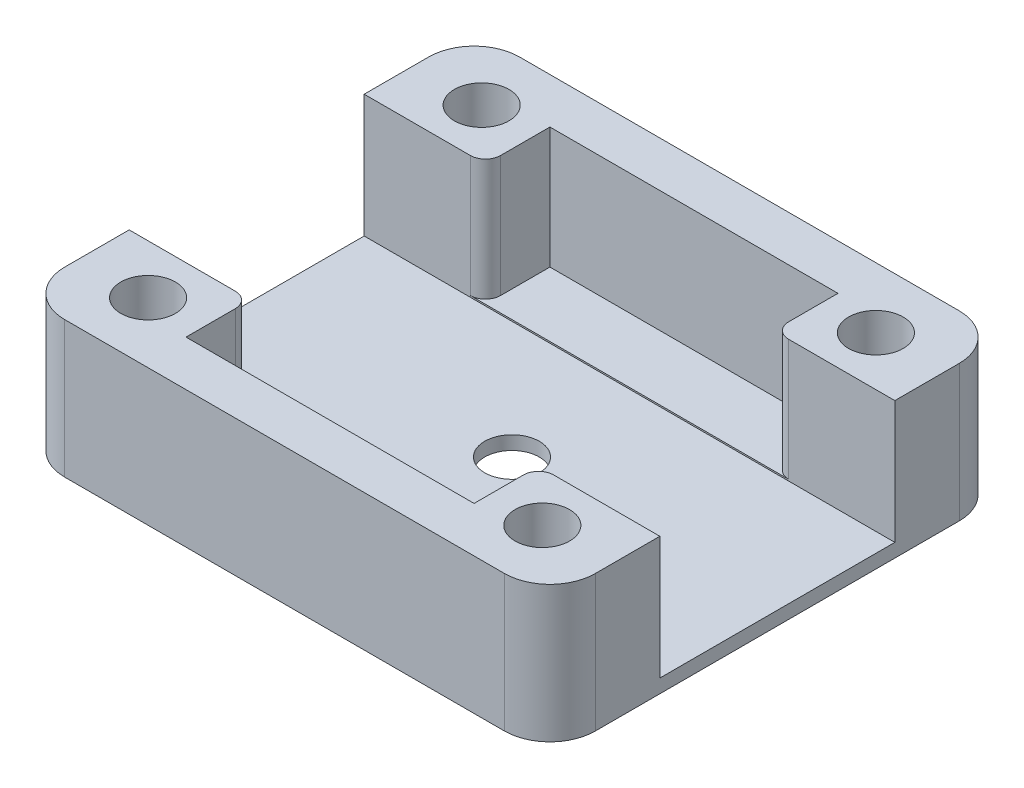
ISO-10303-21;
HEADER;
FILE_DESCRIPTION(('STEP AP214'),'2;1');
FILE_NAME('part.step','',(''),(''),'','','');
FILE_SCHEMA(('AUTOMOTIVE_DESIGN { 1 0 10303 214 1 1 1 1 }'));
ENDSEC;
DATA;
#1=APPLICATION_CONTEXT('core data for automotive mechanical design processes');
#2=APPLICATION_PROTOCOL_DEFINITION('international standard','automotive_design',2000,#1);
#3=PRODUCT_CONTEXT('',#1,'mechanical');
#4=PRODUCT('Part','Part','',(#3));
#5=PRODUCT_RELATED_PRODUCT_CATEGORY('part','',(#4));
#6=PRODUCT_DEFINITION_FORMATION('','',#4);
#7=PRODUCT_DEFINITION_CONTEXT('part definition',#1,'design');
#8=PRODUCT_DEFINITION('design','',#6,#7);
#9=PRODUCT_DEFINITION_SHAPE('','',#8);
#10=(LENGTH_UNIT() NAMED_UNIT(*) SI_UNIT(.MILLI.,.METRE.));
#11=(NAMED_UNIT(*) PLANE_ANGLE_UNIT() SI_UNIT($,.RADIAN.));
#12=(NAMED_UNIT(*) SI_UNIT($,.STERADIAN.) SOLID_ANGLE_UNIT());
#13=UNCERTAINTY_MEASURE_WITH_UNIT(LENGTH_MEASURE(1.E-05),#10,'distance_accuracy_value','');
#14=(GEOMETRIC_REPRESENTATION_CONTEXT(3) GLOBAL_UNCERTAINTY_ASSIGNED_CONTEXT((#13)) GLOBAL_UNIT_ASSIGNED_CONTEXT((#10,
#11,#12)) REPRESENTATION_CONTEXT('',''));
#15=CARTESIAN_POINT('',(0.,0.,0.));
#16=DIRECTION('',(0.,0.,1.));
#17=DIRECTION('',(1.,0.,0.));
#18=AXIS2_PLACEMENT_3D('',#15,#16,#17);
#19=CARTESIAN_POINT('',(0.,0.999999999999999,0.));
#20=DIRECTION('',(0.,1.,0.));
#21=DIRECTION('',(0.,0.,1.));
#22=AXIS2_PLACEMENT_3D('',#19,#20,#21);
#23=PLANE('',#22);
#24=DIRECTION('',(1.,0.,0.));
#25=VECTOR('',#24,1.);
#26=CARTESIAN_POINT('',(0.,0.999999999999999,7.75));
#27=LINE('',#26,#25);
#28=CARTESIAN_POINT('',(-10.5,0.999999999999999,7.75));
#29=VERTEX_POINT('',#28);
#30=CARTESIAN_POINT('',(10.5,0.999999999999999,7.75));
#31=VERTEX_POINT('',#30);
#32=EDGE_CURVE('E285',#29,#31,#27,.T.);
#33=ORIENTED_EDGE('',*,*,#32,.F.);
#34=CARTESIAN_POINT('',(-10.5,0.999999999999999,8.75));
#35=DIRECTION('',(0.,1.,0.));
#36=DIRECTION('',(0.,0.,1.));
#37=AXIS2_PLACEMENT_3D('',#34,#35,#36);
#38=CIRCLE('',#37,1.);
#39=CARTESIAN_POINT('',(-9.49999999999999,0.999999999999999,8.75));
#40=VERTEX_POINT('',#39);
#41=EDGE_CURVE('E350',#29,#40,#38,.F.);
#42=ORIENTED_EDGE('',*,*,#41,.T.);
#43=DIRECTION('',(0.,0.,-1.));
#44=VECTOR('',#43,1.);
#45=CARTESIAN_POINT('',(-9.49999999999999,0.999999999999999,12.));
#46=LINE('',#45,#44);
#47=CARTESIAN_POINT('',(-9.49999999999999,0.999999999999999,12.));
#48=VERTEX_POINT('',#47);
#49=EDGE_CURVE('E744',#48,#40,#46,.T.);
#50=ORIENTED_EDGE('',*,*,#49,.F.);
#51=DIRECTION('',(1.,0.,0.));
#52=VECTOR('',#51,1.);
#53=CARTESIAN_POINT('',(-14.5,0.999999999999999,12.));
#54=LINE('',#53,#52);
#55=CARTESIAN_POINT('',(9.50000000000001,0.999999999999999,12.));
#56=VERTEX_POINT('',#55);
#57=EDGE_CURVE('E254',#48,#56,#54,.T.);
#58=ORIENTED_EDGE('',*,*,#57,.T.);
#59=DIRECTION('',(0.,0.,1.));
#60=VECTOR('',#59,1.);
#61=CARTESIAN_POINT('',(9.50000000000001,0.999999999999999,12.));
#62=LINE('',#61,#60);
#63=CARTESIAN_POINT('',(9.50000000000001,0.999999999999999,8.75));
#64=VERTEX_POINT('',#63);
#65=EDGE_CURVE('E734',#64,#56,#62,.T.);
#66=ORIENTED_EDGE('',*,*,#65,.F.);
#67=CARTESIAN_POINT('',(10.5,0.999999999999999,8.75));
#68=DIRECTION('',(0.,1.,0.));
#69=DIRECTION('',(0.,0.,1.));
#70=AXIS2_PLACEMENT_3D('',#67,#68,#69);
#71=CIRCLE('',#70,1.);
#72=EDGE_CURVE('E347',#64,#31,#71,.F.);
#73=ORIENTED_EDGE('',*,*,#72,.T.);
#74=EDGE_LOOP('',(#33,#42,#50,#58,#66,#73));
#75=FACE_BOUND('',#74,.T.);
#76=ADVANCED_FACE('F40',(#75),#23,.T.);
#77=CARTESIAN_POINT('',(-14.5,0.999999999999999,12.));
#78=DIRECTION('',(0.,0.,1.));
#79=DIRECTION('',(1.,0.,0.));
#80=AXIS2_PLACEMENT_3D('',#77,#78,#79);
#81=PLANE('',#80);
#82=DIRECTION('',(0.,-1.,0.));
#83=VECTOR('',#82,1.);
#84=CARTESIAN_POINT('',(-9.49999999999999,15.5622023742033,12.));
#85=LINE('',#84,#83);
#86=CARTESIAN_POINT('',(-9.49999999999999,9.,12.));
#87=VERTEX_POINT('',#86);
#88=EDGE_CURVE('E736',#87,#48,#85,.T.);
#89=ORIENTED_EDGE('',*,*,#88,.F.);
#90=DIRECTION('',(1.,0.,0.));
#91=VECTOR('',#90,1.);
#92=CARTESIAN_POINT('',(-14.5,9.,12.));
#93=LINE('',#92,#91);
#94=CARTESIAN_POINT('',(9.50000000000001,9.,12.));
#95=VERTEX_POINT('',#94);
#96=EDGE_CURVE('E248',#87,#95,#93,.T.);
#97=ORIENTED_EDGE('',*,*,#96,.T.);
#98=DIRECTION('',(0.,-1.,0.));
#99=VECTOR('',#98,1.);
#100=CARTESIAN_POINT('',(9.50000000000001,15.5622023742033,12.));
#101=LINE('',#100,#99);
#102=EDGE_CURVE('E721',#95,#56,#101,.T.);
#103=ORIENTED_EDGE('',*,*,#102,.T.);
#104=ORIENTED_EDGE('',*,*,#57,.F.);
#105=EDGE_LOOP('',(#89,#97,#103,#104));
#106=FACE_BOUND('',#105,.T.);
#107=ADVANCED_FACE('F420',(#106),#81,.F.);
#108=CARTESIAN_POINT('',(14.5,0.999999999999999,-12.));
#109=DIRECTION('',(0.,0.,-1.));
#110=DIRECTION('',(-1.,0.,0.));
#111=AXIS2_PLACEMENT_3D('',#108,#109,#110);
#112=PLANE('',#111);
#113=DIRECTION('',(0.,-1.,0.));
#114=VECTOR('',#113,1.);
#115=CARTESIAN_POINT('',(9.50000000000001,15.5622023742033,-12.));
#116=LINE('',#115,#114);
#117=CARTESIAN_POINT('',(9.50000000000001,9.,-12.));
#118=VERTEX_POINT('',#117);
#119=CARTESIAN_POINT('',(9.50000000000001,0.999999999999999,-12.));
#120=VERTEX_POINT('',#119);
#121=EDGE_CURVE('E715',#118,#120,#116,.T.);
#122=ORIENTED_EDGE('',*,*,#121,.F.);
#123=DIRECTION('',(-1.,0.,0.));
#124=VECTOR('',#123,1.);
#125=CARTESIAN_POINT('',(14.5,9.,-12.));
#126=LINE('',#125,#124);
#127=CARTESIAN_POINT('',(-9.5,9.,-12.));
#128=VERTEX_POINT('',#127);
#129=EDGE_CURVE('E258',#118,#128,#126,.T.);
#130=ORIENTED_EDGE('',*,*,#129,.T.);
#131=DIRECTION('',(0.,-1.,0.));
#132=VECTOR('',#131,1.);
#133=CARTESIAN_POINT('',(-9.5,15.5622023742033,-12.));
#134=LINE('',#133,#132);
#135=CARTESIAN_POINT('',(-9.5,0.999999999999999,-12.));
#136=VERTEX_POINT('',#135);
#137=EDGE_CURVE('E236',#128,#136,#134,.T.);
#138=ORIENTED_EDGE('',*,*,#137,.T.);
#139=DIRECTION('',(-1.,0.,0.));
#140=VECTOR('',#139,1.);
#141=CARTESIAN_POINT('',(14.5,0.999999999999999,-12.));
#142=LINE('',#141,#140);
#143=EDGE_CURVE('E257',#120,#136,#142,.T.);
#144=ORIENTED_EDGE('',*,*,#143,.F.);
#145=EDGE_LOOP('',(#122,#130,#138,#144));
#146=FACE_BOUND('',#145,.T.);
#147=ADVANCED_FACE('F426',(#146),#112,.F.);
#148=DIRECTION('',(-1.,0.,0.));
#149=VECTOR('',#148,1.);
#150=CARTESIAN_POINT('',(0.,0.999999999999999,-7.75));
#151=LINE('',#150,#149);
#152=CARTESIAN_POINT('',(10.5,0.999999999999999,-7.75));
#153=VERTEX_POINT('',#152);
#154=CARTESIAN_POINT('',(-10.5,0.999999999999999,-7.75));
#155=VERTEX_POINT('',#154);
#156=EDGE_CURVE('E272',#153,#155,#151,.T.);
#157=ORIENTED_EDGE('',*,*,#156,.F.);
#158=CARTESIAN_POINT('',(10.5,0.999999999999999,-8.75));
#159=DIRECTION('',(0.,1.,0.));
#160=DIRECTION('',(0.,0.,1.));
#161=AXIS2_PLACEMENT_3D('',#158,#159,#160);
#162=CIRCLE('',#161,1.);
#163=CARTESIAN_POINT('',(9.50000000000001,0.999999999999999,-8.75));
#164=VERTEX_POINT('',#163);
#165=EDGE_CURVE('E11',#153,#164,#162,.F.);
#166=ORIENTED_EDGE('',*,*,#165,.T.);
#167=DIRECTION('',(0.,0.,1.));
#168=VECTOR('',#167,1.);
#169=CARTESIAN_POINT('',(9.50000000000001,0.999999999999999,-12.));
#170=LINE('',#169,#168);
#171=EDGE_CURVE('E717',#120,#164,#170,.T.);
#172=ORIENTED_EDGE('',*,*,#171,.F.);
#173=ORIENTED_EDGE('',*,*,#143,.T.);
#174=DIRECTION('',(0.,0.,-1.));
#175=VECTOR('',#174,1.);
#176=CARTESIAN_POINT('',(-9.5,0.999999999999999,-12.));
#177=LINE('',#176,#175);
#178=CARTESIAN_POINT('',(-9.5,0.999999999999999,-8.75));
#179=VERTEX_POINT('',#178);
#180=EDGE_CURVE('E355',#179,#136,#177,.T.);
#181=ORIENTED_EDGE('',*,*,#180,.F.);
#182=CARTESIAN_POINT('',(-10.5,0.999999999999999,-8.75));
#183=DIRECTION('',(0.,1.,0.));
#184=DIRECTION('',(0.,0.,1.));
#185=AXIS2_PLACEMENT_3D('',#182,#183,#184);
#186=CIRCLE('',#185,1.);
#187=EDGE_CURVE('E48',#179,#155,#186,.F.);
#188=ORIENTED_EDGE('',*,*,#187,.T.);
#189=EDGE_LOOP('',(#157,#166,#172,#173,#181,#188));
#190=FACE_BOUND('',#189,.T.);
#191=ADVANCED_FACE('F354',(#190),#23,.T.);
#192=CARTESIAN_POINT('',(0.,9.,0.));
#193=DIRECTION('',(0.,-1.,0.));
#194=DIRECTION('',(0.,0.,-1.));
#195=AXIS2_PLACEMENT_3D('',#192,#193,#194);
#196=PLANE('',#195);
#197=CARTESIAN_POINT('',(-13.,9.,11.));
#198=DIRECTION('',(0.,1.,0.));
#199=DIRECTION('',(0.,0.,1.));
#200=AXIS2_PLACEMENT_3D('',#197,#198,#199);
#201=CIRCLE('',#200,1.79999999999999);
#202=CARTESIAN_POINT('',(-13.,9.,12.8));
#203=VERTEX_POINT('',#202);
#204=EDGE_CURVE('E767',#203,#203,#201,.T.);
#205=ORIENTED_EDGE('',*,*,#204,.F.);
#206=EDGE_LOOP('',(#205));
#207=FACE_BOUND('',#206,.T.);
#208=CARTESIAN_POINT('',(13.,9.,11.));
#209=DIRECTION('',(0.,1.,0.));
#210=DIRECTION('',(0.,0.,1.));
#211=AXIS2_PLACEMENT_3D('',#208,#209,#210);
#212=CIRCLE('',#211,1.79999999999999);
#213=CARTESIAN_POINT('',(13.,9.,12.8));
#214=VERTEX_POINT('',#213);
#215=EDGE_CURVE('E751',#214,#214,#212,.T.);
#216=ORIENTED_EDGE('',*,*,#215,.F.);
#217=EDGE_LOOP('',(#216));
#218=FACE_BOUND('',#217,.T.);
#219=DIRECTION('',(-1.,0.,0.));
#220=VECTOR('',#219,1.);
#221=CARTESIAN_POINT('',(17.5,9.,7.75));
#222=LINE('',#221,#220);
#223=CARTESIAN_POINT('',(17.5,9.,7.75));
#224=VERTEX_POINT('',#223);
#225=CARTESIAN_POINT('',(10.5,9.,7.75));
#226=VERTEX_POINT('',#225);
#227=EDGE_CURVE('E202',#224,#226,#222,.T.);
#228=ORIENTED_EDGE('',*,*,#227,.T.);
#229=CARTESIAN_POINT('',(10.5,9.,8.75));
#230=DIRECTION('',(0.,-1.,0.));
#231=DIRECTION('',(0.,0.,-1.));
#232=AXIS2_PLACEMENT_3D('',#229,#230,#231);
#233=CIRCLE('',#232,1.);
#234=CARTESIAN_POINT('',(9.50000000000001,9.,8.75));
#235=VERTEX_POINT('',#234);
#236=EDGE_CURVE('E330',#226,#235,#233,.F.);
#237=ORIENTED_EDGE('',*,*,#236,.T.);
#238=DIRECTION('',(0.,0.,-1.));
#239=VECTOR('',#238,1.);
#240=CARTESIAN_POINT('',(9.50000000000001,9.,12.));
#241=LINE('',#240,#239);
#242=EDGE_CURVE('E723',#95,#235,#241,.T.);
#243=ORIENTED_EDGE('',*,*,#242,.F.);
#244=ORIENTED_EDGE('',*,*,#96,.F.);
#245=DIRECTION('',(0.,0.,1.));
#246=VECTOR('',#245,1.);
#247=CARTESIAN_POINT('',(-9.49999999999999,9.,12.));
#248=LINE('',#247,#246);
#249=CARTESIAN_POINT('',(-9.49999999999999,9.,8.75));
#250=VERTEX_POINT('',#249);
#251=EDGE_CURVE('E738',#250,#87,#248,.T.);
#252=ORIENTED_EDGE('',*,*,#251,.F.);
#253=CARTESIAN_POINT('',(-10.5,9.,8.75));
#254=DIRECTION('',(0.,-1.,0.));
#255=DIRECTION('',(0.,0.,-1.));
#256=AXIS2_PLACEMENT_3D('',#253,#254,#255);
#257=CIRCLE('',#256,1.);
#258=CARTESIAN_POINT('',(-10.5,9.,7.75));
#259=VERTEX_POINT('',#258);
#260=EDGE_CURVE('E328',#250,#259,#257,.F.);
#261=ORIENTED_EDGE('',*,*,#260,.T.);
#262=CARTESIAN_POINT('',(-17.5,9.,7.75));
#263=VERTEX_POINT('',#262);
#264=EDGE_CURVE('E222',#259,#263,#222,.T.);
#265=ORIENTED_EDGE('',*,*,#264,.T.);
#266=DIRECTION('',(0.,0.,1.));
#267=VECTOR('',#266,1.);
#268=CARTESIAN_POINT('',(-17.5,9.,15.));
#269=LINE('',#268,#267);
#270=CARTESIAN_POINT('',(-17.5,9.,12.));
#271=VERTEX_POINT('',#270);
#272=EDGE_CURVE('E266',#263,#271,#269,.T.);
#273=ORIENTED_EDGE('',*,*,#272,.T.);
#274=CARTESIAN_POINT('',(-14.5,9.,12.));
#275=DIRECTION('',(0.,-1.,0.));
#276=DIRECTION('',(0.,0.,-1.));
#277=AXIS2_PLACEMENT_3D('',#274,#275,#276);
#278=CIRCLE('',#277,3.);
#279=CARTESIAN_POINT('',(-14.5,9.,15.));
#280=VERTEX_POINT('',#279);
#281=EDGE_CURVE('E306',#271,#280,#278,.F.);
#282=ORIENTED_EDGE('',*,*,#281,.T.);
#283=DIRECTION('',(1.,0.,0.));
#284=VECTOR('',#283,1.);
#285=CARTESIAN_POINT('',(-17.5,9.,15.));
#286=LINE('',#285,#284);
#287=CARTESIAN_POINT('',(14.5,9.,15.));
#288=VERTEX_POINT('',#287);
#289=EDGE_CURVE('E270',#280,#288,#286,.T.);
#290=ORIENTED_EDGE('',*,*,#289,.T.);
#291=CARTESIAN_POINT('',(14.5,9.,12.));
#292=DIRECTION('',(0.,-1.,0.));
#293=DIRECTION('',(0.,0.,-1.));
#294=AXIS2_PLACEMENT_3D('',#291,#292,#293);
#295=CIRCLE('',#294,3.);
#296=CARTESIAN_POINT('',(17.5,9.,12.));
#297=VERTEX_POINT('',#296);
#298=EDGE_CURVE('E206',#288,#297,#295,.F.);
#299=ORIENTED_EDGE('',*,*,#298,.T.);
#300=DIRECTION('',(0.,0.,-1.));
#301=VECTOR('',#300,1.);
#302=CARTESIAN_POINT('',(17.5,9.,15.));
#303=LINE('',#302,#301);
#304=EDGE_CURVE('E199',#297,#224,#303,.T.);
#305=ORIENTED_EDGE('',*,*,#304,.T.);
#306=EDGE_LOOP('',(#228,#237,#243,#244,#252,#261,#265,#273,#282,#290,#299,#305));
#307=FACE_BOUND('',#306,.T.);
#308=ADVANCED_FACE('F201',(#207,#218,#307),#196,.F.);
#309=CARTESIAN_POINT('',(17.5,9.,15.));
#310=DIRECTION('',(-1.,0.,0.));
#311=DIRECTION('',(0.,0.,1.));
#312=AXIS2_PLACEMENT_3D('',#309,#310,#311);
#313=PLANE('',#312);
#314=ORIENTED_EDGE('',*,*,#304,.F.);
#315=DIRECTION('',(0.,-1.,0.));
#316=VECTOR('',#315,1.);
#317=CARTESIAN_POINT('',(17.5,9.,12.));
#318=LINE('',#317,#316);
#319=CARTESIAN_POINT('',(17.5,0.,12.));
#320=VERTEX_POINT('',#319);
#321=EDGE_CURVE('E310',#297,#320,#318,.T.);
#322=ORIENTED_EDGE('',*,*,#321,.T.);
#323=DIRECTION('',(0.,0.,-1.));
#324=VECTOR('',#323,1.);
#325=CARTESIAN_POINT('',(17.5,0.,15.));
#326=LINE('',#325,#324);
#327=CARTESIAN_POINT('',(17.5,0.,-12.));
#328=VERTEX_POINT('',#327);
#329=EDGE_CURVE('E261',#320,#328,#326,.T.);
#330=ORIENTED_EDGE('',*,*,#329,.T.);
#331=DIRECTION('',(0.,-1.,0.));
#332=VECTOR('',#331,1.);
#333=CARTESIAN_POINT('',(17.5,9.,-12.));
#334=LINE('',#333,#332);
#335=CARTESIAN_POINT('',(17.5,9.,-12.));
#336=VERTEX_POINT('',#335);
#337=EDGE_CURVE('E308',#328,#336,#334,.F.);
#338=ORIENTED_EDGE('',*,*,#337,.T.);
#339=CARTESIAN_POINT('',(17.5,9.,-7.75));
#340=VERTEX_POINT('',#339);
#341=EDGE_CURVE('E212',#340,#336,#303,.T.);
#342=ORIENTED_EDGE('',*,*,#341,.F.);
#343=DIRECTION('',(0.,-1.,0.));
#344=VECTOR('',#343,1.);
#345=CARTESIAN_POINT('',(17.5,0.9,-7.75));
#346=LINE('',#345,#344);
#347=CARTESIAN_POINT('',(17.5,0.9,-7.75));
#348=VERTEX_POINT('',#347);
#349=EDGE_CURVE('E228',#340,#348,#346,.T.);
#350=ORIENTED_EDGE('',*,*,#349,.T.);
#351=DIRECTION('',(0.,0.,1.));
#352=VECTOR('',#351,1.);
#353=CARTESIAN_POINT('',(17.5,0.9,-7.75));
#354=LINE('',#353,#352);
#355=CARTESIAN_POINT('',(17.5,0.9,7.75));
#356=VERTEX_POINT('',#355);
#357=EDGE_CURVE('E227',#348,#356,#354,.T.);
#358=ORIENTED_EDGE('',*,*,#357,.T.);
#359=DIRECTION('',(0.,1.,0.));
#360=VECTOR('',#359,1.);
#361=CARTESIAN_POINT('',(17.5,0.9,7.75));
#362=LINE('',#361,#360);
#363=EDGE_CURVE('E217',#356,#224,#362,.T.);
#364=ORIENTED_EDGE('',*,*,#363,.T.);
#365=EDGE_LOOP('',(#314,#322,#330,#338,#342,#350,#358,#364));
#366=FACE_BOUND('',#365,.T.);
#367=ADVANCED_FACE('F224',(#366),#313,.F.);
#368=CARTESIAN_POINT('',(-17.5,9.,-15.));
#369=DIRECTION('',(0.,0.,1.));
#370=DIRECTION('',(1.,0.,0.));
#371=AXIS2_PLACEMENT_3D('',#368,#369,#370);
#372=PLANE('',#371);
#373=DIRECTION('',(-1.,0.,0.));
#374=VECTOR('',#373,1.);
#375=CARTESIAN_POINT('',(-17.5,9.,-15.));
#376=LINE('',#375,#374);
#377=CARTESIAN_POINT('',(14.5,9.,-15.));
#378=VERTEX_POINT('',#377);
#379=CARTESIAN_POINT('',(-14.5,9.,-15.));
#380=VERTEX_POINT('',#379);
#381=EDGE_CURVE('E211',#378,#380,#376,.T.);
#382=ORIENTED_EDGE('',*,*,#381,.F.);
#383=DIRECTION('',(0.,-1.,0.));
#384=VECTOR('',#383,1.);
#385=CARTESIAN_POINT('',(14.5,9.,-15.));
#386=LINE('',#385,#384);
#387=CARTESIAN_POINT('',(14.5,0.,-15.));
#388=VERTEX_POINT('',#387);
#389=EDGE_CURVE('E314',#378,#388,#386,.T.);
#390=ORIENTED_EDGE('',*,*,#389,.T.);
#391=DIRECTION('',(-1.,0.,0.));
#392=VECTOR('',#391,1.);
#393=CARTESIAN_POINT('',(-17.5,0.,-15.));
#394=LINE('',#393,#392);
#395=CARTESIAN_POINT('',(-14.5,0.,-15.));
#396=VERTEX_POINT('',#395);
#397=EDGE_CURVE('E275',#388,#396,#394,.T.);
#398=ORIENTED_EDGE('',*,*,#397,.T.);
#399=DIRECTION('',(0.,-1.,0.));
#400=VECTOR('',#399,1.);
#401=CARTESIAN_POINT('',(-14.5,9.,-15.));
#402=LINE('',#401,#400);
#403=EDGE_CURVE('E312',#396,#380,#402,.F.);
#404=ORIENTED_EDGE('',*,*,#403,.T.);
#405=EDGE_LOOP('',(#382,#390,#398,#404));
#406=FACE_BOUND('',#405,.T.);
#407=ADVANCED_FACE('F388',(#406),#372,.F.);
#408=CARTESIAN_POINT('',(-17.5,9.,15.));
#409=DIRECTION('',(1.,0.,0.));
#410=DIRECTION('',(0.,0.,-1.));
#411=AXIS2_PLACEMENT_3D('',#408,#409,#410);
#412=PLANE('',#411);
#413=DIRECTION('',(0.,0.,1.));
#414=VECTOR('',#413,1.);
#415=CARTESIAN_POINT('',(-17.5,0.,15.));
#416=LINE('',#415,#414);
#417=CARTESIAN_POINT('',(-17.5,0.,-12.));
#418=VERTEX_POINT('',#417);
#419=CARTESIAN_POINT('',(-17.5,0.,12.));
#420=VERTEX_POINT('',#419);
#421=EDGE_CURVE('E278',#418,#420,#416,.T.);
#422=ORIENTED_EDGE('',*,*,#421,.T.);
#423=DIRECTION('',(0.,-1.,0.));
#424=VECTOR('',#423,1.);
#425=CARTESIAN_POINT('',(-17.5,9.,12.));
#426=LINE('',#425,#424);
#427=EDGE_CURVE('E303',#420,#271,#426,.F.);
#428=ORIENTED_EDGE('',*,*,#427,.T.);
#429=ORIENTED_EDGE('',*,*,#272,.F.);
#430=DIRECTION('',(0.,1.,0.));
#431=VECTOR('',#430,1.);
#432=CARTESIAN_POINT('',(-17.5,0.9,7.75));
#433=LINE('',#432,#431);
#434=CARTESIAN_POINT('',(-17.5,0.9,7.75));
#435=VERTEX_POINT('',#434);
#436=EDGE_CURVE('E240',#435,#263,#433,.T.);
#437=ORIENTED_EDGE('',*,*,#436,.F.);
#438=DIRECTION('',(0.,0.,1.));
#439=VECTOR('',#438,1.);
#440=CARTESIAN_POINT('',(-17.5,0.9,-7.75));
#441=LINE('',#440,#439);
#442=CARTESIAN_POINT('',(-17.5,0.9,-7.75));
#443=VERTEX_POINT('',#442);
#444=EDGE_CURVE('E229',#443,#435,#441,.T.);
#445=ORIENTED_EDGE('',*,*,#444,.F.);
#446=DIRECTION('',(0.,-1.,0.));
#447=VECTOR('',#446,1.);
#448=CARTESIAN_POINT('',(-17.5,0.9,-7.75));
#449=LINE('',#448,#447);
#450=CARTESIAN_POINT('',(-17.5,9.,-7.75));
#451=VERTEX_POINT('',#450);
#452=EDGE_CURVE('E233',#451,#443,#449,.T.);
#453=ORIENTED_EDGE('',*,*,#452,.F.);
#454=CARTESIAN_POINT('',(-17.5,9.,-12.));
#455=VERTEX_POINT('',#454);
#456=EDGE_CURVE('E267',#455,#451,#269,.T.);
#457=ORIENTED_EDGE('',*,*,#456,.F.);
#458=DIRECTION('',(0.,-1.,0.));
#459=VECTOR('',#458,1.);
#460=CARTESIAN_POINT('',(-17.5,9.,-12.));
#461=LINE('',#460,#459);
#462=EDGE_CURVE('E300',#455,#418,#461,.T.);
#463=ORIENTED_EDGE('',*,*,#462,.T.);
#464=EDGE_LOOP('',(#422,#428,#429,#437,#445,#453,#457,#463));
#465=FACE_BOUND('',#464,.T.);
#466=ADVANCED_FACE('F373',(#465),#412,.F.);
#467=CARTESIAN_POINT('',(-17.5,9.,15.));
#468=DIRECTION('',(0.,0.,-1.));
#469=DIRECTION('',(-1.,0.,0.));
#470=AXIS2_PLACEMENT_3D('',#467,#468,#469);
#471=PLANE('',#470);
#472=ORIENTED_EDGE('',*,*,#289,.F.);
#473=DIRECTION('',(0.,-1.,0.));
#474=VECTOR('',#473,1.);
#475=CARTESIAN_POINT('',(-14.5,9.,15.));
#476=LINE('',#475,#474);
#477=CARTESIAN_POINT('',(-14.5,0.,15.));
#478=VERTEX_POINT('',#477);
#479=EDGE_CURVE('E289',#280,#478,#476,.T.);
#480=ORIENTED_EDGE('',*,*,#479,.T.);
#481=DIRECTION('',(1.,0.,0.));
#482=VECTOR('',#481,1.);
#483=CARTESIAN_POINT('',(-17.5,0.,15.));
#484=LINE('',#483,#482);
#485=CARTESIAN_POINT('',(14.5,0.,15.));
#486=VERTEX_POINT('',#485);
#487=EDGE_CURVE('E281',#478,#486,#484,.T.);
#488=ORIENTED_EDGE('',*,*,#487,.T.);
#489=DIRECTION('',(0.,-1.,0.));
#490=VECTOR('',#489,1.);
#491=CARTESIAN_POINT('',(14.5,9.,15.));
#492=LINE('',#491,#490);
#493=EDGE_CURVE('E287',#486,#288,#492,.F.);
#494=ORIENTED_EDGE('',*,*,#493,.T.);
#495=EDGE_LOOP('',(#472,#480,#488,#494));
#496=FACE_BOUND('',#495,.T.);
#497=ADVANCED_FACE('F406',(#496),#471,.F.);
#498=CARTESIAN_POINT('',(13.,9.,-11.));
#499=DIRECTION('',(0.,1.,0.));
#500=DIRECTION('',(0.,0.,1.));
#501=AXIS2_PLACEMENT_3D('',#498,#499,#500);
#502=CIRCLE('',#501,1.79999999999999);
#503=CARTESIAN_POINT('',(13.,9.,-9.20000000000001));
#504=VERTEX_POINT('',#503);
#505=EDGE_CURVE('E773',#504,#504,#502,.T.);
#506=ORIENTED_EDGE('',*,*,#505,.F.);
#507=EDGE_LOOP('',(#506));
#508=FACE_BOUND('',#507,.T.);
#509=CARTESIAN_POINT('',(-13.,9.,-11.));
#510=DIRECTION('',(0.,1.,0.));
#511=DIRECTION('',(0.,0.,1.));
#512=AXIS2_PLACEMENT_3D('',#509,#510,#511);
#513=CIRCLE('',#512,1.79999999999999);
#514=CARTESIAN_POINT('',(-13.,9.,-9.20000000000001));
#515=VERTEX_POINT('',#514);
#516=EDGE_CURVE('E759',#515,#515,#513,.T.);
#517=ORIENTED_EDGE('',*,*,#516,.F.);
#518=EDGE_LOOP('',(#517));
#519=FACE_BOUND('',#518,.T.);
#520=DIRECTION('',(-1.,0.,0.));
#521=VECTOR('',#520,1.);
#522=CARTESIAN_POINT('',(17.5,9.,-7.75));
#523=LINE('',#522,#521);
#524=CARTESIAN_POINT('',(-10.5,9.,-7.75));
#525=VERTEX_POINT('',#524);
#526=EDGE_CURVE('E221',#525,#451,#523,.T.);
#527=ORIENTED_EDGE('',*,*,#526,.F.);
#528=CARTESIAN_POINT('',(-10.5,9.,-8.75));
#529=DIRECTION('',(0.,-1.,0.));
#530=DIRECTION('',(0.,0.,-1.));
#531=AXIS2_PLACEMENT_3D('',#528,#529,#530);
#532=CIRCLE('',#531,1.);
#533=CARTESIAN_POINT('',(-9.5,9.,-8.75));
#534=VERTEX_POINT('',#533);
#535=EDGE_CURVE('E344',#525,#534,#532,.F.);
#536=ORIENTED_EDGE('',*,*,#535,.T.);
#537=DIRECTION('',(0.,0.,1.));
#538=VECTOR('',#537,1.);
#539=CARTESIAN_POINT('',(-9.5,9.,-12.));
#540=LINE('',#539,#538);
#541=EDGE_CURVE('E243',#128,#534,#540,.T.);
#542=ORIENTED_EDGE('',*,*,#541,.F.);
#543=ORIENTED_EDGE('',*,*,#129,.F.);
#544=DIRECTION('',(0.,0.,-1.));
#545=VECTOR('',#544,1.);
#546=CARTESIAN_POINT('',(9.50000000000001,9.,-12.));
#547=LINE('',#546,#545);
#548=CARTESIAN_POINT('',(9.50000000000001,9.,-8.75));
#549=VERTEX_POINT('',#548);
#550=EDGE_CURVE('E713',#549,#118,#547,.T.);
#551=ORIENTED_EDGE('',*,*,#550,.F.);
#552=CARTESIAN_POINT('',(10.5,9.,-8.75));
#553=DIRECTION('',(0.,-1.,0.));
#554=DIRECTION('',(0.,0.,-1.));
#555=AXIS2_PLACEMENT_3D('',#552,#553,#554);
#556=CIRCLE('',#555,1.);
#557=CARTESIAN_POINT('',(10.5,9.,-7.75));
#558=VERTEX_POINT('',#557);
#559=EDGE_CURVE('E342',#549,#558,#556,.F.);
#560=ORIENTED_EDGE('',*,*,#559,.T.);
#561=EDGE_CURVE('E251',#340,#558,#523,.T.);
#562=ORIENTED_EDGE('',*,*,#561,.F.);
#563=ORIENTED_EDGE('',*,*,#341,.T.);
#564=CARTESIAN_POINT('',(14.5,9.,-12.));
#565=DIRECTION('',(0.,-1.,0.));
#566=DIRECTION('',(0.,0.,-1.));
#567=AXIS2_PLACEMENT_3D('',#564,#565,#566);
#568=CIRCLE('',#567,3.);
#569=EDGE_CURVE('E319',#336,#378,#568,.F.);
#570=ORIENTED_EDGE('',*,*,#569,.T.);
#571=ORIENTED_EDGE('',*,*,#381,.T.);
#572=CARTESIAN_POINT('',(-14.5,9.,-12.));
#573=DIRECTION('',(0.,-1.,0.));
#574=DIRECTION('',(0.,0.,-1.));
#575=AXIS2_PLACEMENT_3D('',#572,#573,#574);
#576=CIRCLE('',#575,3.);
#577=EDGE_CURVE('E317',#380,#455,#576,.F.);
#578=ORIENTED_EDGE('',*,*,#577,.T.);
#579=ORIENTED_EDGE('',*,*,#456,.T.);
#580=EDGE_LOOP('',(#527,#536,#542,#543,#551,#560,#562,#563,#570,#571,#578,#579));
#581=FACE_BOUND('',#580,.T.);
#582=ADVANCED_FACE('F364',(#508,#519,#581),#196,.F.);
#583=CARTESIAN_POINT('',(0.,0.,0.));
#584=DIRECTION('',(0.,-1.,0.));
#585=DIRECTION('',(0.,0.,-1.));
#586=AXIS2_PLACEMENT_3D('',#583,#584,#585);
#587=PLANE('',#586);
#588=CARTESIAN_POINT('',(0.,0.,0.));
#589=DIRECTION('',(0.,1.,0.));
#590=DIRECTION('',(0.,0.,1.));
#591=AXIS2_PLACEMENT_3D('',#588,#589,#590);
#592=CIRCLE('',#591,1.8);
#593=CARTESIAN_POINT('',(0.,0.,1.8));
#594=VERTEX_POINT('',#593);
#595=EDGE_CURVE('E779',#594,#594,#592,.T.);
#596=ORIENTED_EDGE('',*,*,#595,.T.);
#597=EDGE_LOOP('',(#596));
#598=FACE_BOUND('',#597,.T.);
#599=CARTESIAN_POINT('',(13.,0.,-11.));
#600=DIRECTION('',(0.,1.,0.));
#601=DIRECTION('',(0.,0.,1.));
#602=AXIS2_PLACEMENT_3D('',#599,#600,#601);
#603=CIRCLE('',#602,1.8);
#604=CARTESIAN_POINT('',(13.,0.,-9.2));
#605=VERTEX_POINT('',#604);
#606=EDGE_CURVE('E770',#605,#605,#603,.T.);
#607=ORIENTED_EDGE('',*,*,#606,.T.);
#608=EDGE_LOOP('',(#607));
#609=FACE_BOUND('',#608,.T.);
#610=CARTESIAN_POINT('',(-13.,0.,11.));
#611=DIRECTION('',(0.,1.,0.));
#612=DIRECTION('',(0.,0.,1.));
#613=AXIS2_PLACEMENT_3D('',#610,#611,#612);
#614=CIRCLE('',#613,1.8);
#615=CARTESIAN_POINT('',(-13.,0.,12.8));
#616=VERTEX_POINT('',#615);
#617=EDGE_CURVE('E764',#616,#616,#614,.T.);
#618=ORIENTED_EDGE('',*,*,#617,.T.);
#619=EDGE_LOOP('',(#618));
#620=FACE_BOUND('',#619,.T.);
#621=CARTESIAN_POINT('',(-13.,0.,-11.));
#622=DIRECTION('',(0.,1.,0.));
#623=DIRECTION('',(0.,0.,1.));
#624=AXIS2_PLACEMENT_3D('',#621,#622,#623);
#625=CIRCLE('',#624,1.8);
#626=CARTESIAN_POINT('',(-13.,0.,-9.2));
#627=VERTEX_POINT('',#626);
#628=EDGE_CURVE('E755',#627,#627,#625,.T.);
#629=ORIENTED_EDGE('',*,*,#628,.T.);
#630=EDGE_LOOP('',(#629));
#631=FACE_BOUND('',#630,.T.);
#632=CARTESIAN_POINT('',(13.,0.,11.));
#633=DIRECTION('',(0.,1.,0.));
#634=DIRECTION('',(0.,0.,1.));
#635=AXIS2_PLACEMENT_3D('',#632,#633,#634);
#636=CIRCLE('',#635,1.8);
#637=CARTESIAN_POINT('',(13.,0.,12.8));
#638=VERTEX_POINT('',#637);
#639=EDGE_CURVE('E746',#638,#638,#636,.T.);
#640=ORIENTED_EDGE('',*,*,#639,.T.);
#641=EDGE_LOOP('',(#640));
#642=FACE_BOUND('',#641,.T.);
#643=ORIENTED_EDGE('',*,*,#487,.F.);
#644=CARTESIAN_POINT('',(-14.5,0.,12.));
#645=DIRECTION('',(0.,-1.,0.));
#646=DIRECTION('',(0.,0.,-1.));
#647=AXIS2_PLACEMENT_3D('',#644,#645,#646);
#648=CIRCLE('',#647,3.);
#649=EDGE_CURVE('E298',#478,#420,#648,.T.);
#650=ORIENTED_EDGE('',*,*,#649,.T.);
#651=ORIENTED_EDGE('',*,*,#421,.F.);
#652=CARTESIAN_POINT('',(-14.5,0.,-12.));
#653=DIRECTION('',(0.,-1.,0.));
#654=DIRECTION('',(0.,0.,-1.));
#655=AXIS2_PLACEMENT_3D('',#652,#653,#654);
#656=CIRCLE('',#655,3.);
#657=EDGE_CURVE('E292',#418,#396,#656,.T.);
#658=ORIENTED_EDGE('',*,*,#657,.T.);
#659=ORIENTED_EDGE('',*,*,#397,.F.);
#660=CARTESIAN_POINT('',(14.5,0.,-12.));
#661=DIRECTION('',(0.,-1.,0.));
#662=DIRECTION('',(0.,0.,-1.));
#663=AXIS2_PLACEMENT_3D('',#660,#661,#662);
#664=CIRCLE('',#663,3.);
#665=EDGE_CURVE('E294',#388,#328,#664,.T.);
#666=ORIENTED_EDGE('',*,*,#665,.T.);
#667=ORIENTED_EDGE('',*,*,#329,.F.);
#668=CARTESIAN_POINT('',(14.5,0.,12.));
#669=DIRECTION('',(0.,-1.,0.));
#670=DIRECTION('',(0.,0.,-1.));
#671=AXIS2_PLACEMENT_3D('',#668,#669,#670);
#672=CIRCLE('',#671,3.);
#673=EDGE_CURVE('E296',#320,#486,#672,.T.);
#674=ORIENTED_EDGE('',*,*,#673,.T.);
#675=EDGE_LOOP('',(#643,#650,#651,#658,#659,#666,#667,#674));
#676=FACE_BOUND('',#675,.T.);
#677=ADVANCED_FACE('F392',(#598,#609,#620,#631,#642,#676),#587,.T.);
#678=CARTESIAN_POINT('',(17.5,0.9,7.75));
#679=DIRECTION('',(0.,0.,1.));
#680=DIRECTION('',(1.,0.,0.));
#681=AXIS2_PLACEMENT_3D('',#678,#679,#680);
#682=PLANE('',#681);
#683=ORIENTED_EDGE('',*,*,#32,.T.);
#684=DIRECTION('',(0.,-1.,0.));
#685=VECTOR('',#684,1.);
#686=CARTESIAN_POINT('',(10.5,0.9,7.75));
#687=LINE('',#686,#685);
#688=EDGE_CURVE('E220',#31,#226,#687,.F.);
#689=ORIENTED_EDGE('',*,*,#688,.T.);
#690=ORIENTED_EDGE('',*,*,#227,.F.);
#691=ORIENTED_EDGE('',*,*,#363,.F.);
#692=DIRECTION('',(-1.,0.,0.));
#693=VECTOR('',#692,1.);
#694=CARTESIAN_POINT('',(17.5,0.9,7.75));
#695=LINE('',#694,#693);
#696=EDGE_CURVE('E246',#356,#435,#695,.T.);
#697=ORIENTED_EDGE('',*,*,#696,.T.);
#698=ORIENTED_EDGE('',*,*,#436,.T.);
#699=ORIENTED_EDGE('',*,*,#264,.F.);
#700=DIRECTION('',(0.,-1.,0.));
#701=VECTOR('',#700,1.);
#702=CARTESIAN_POINT('',(-10.5,0.9,7.75));
#703=LINE('',#702,#701);
#704=EDGE_CURVE('E324',#259,#29,#703,.T.);
#705=ORIENTED_EDGE('',*,*,#704,.T.);
#706=EDGE_LOOP('',(#683,#689,#690,#691,#697,#698,#699,#705));
#707=FACE_BOUND('',#706,.T.);
#708=ADVANCED_FACE('F216',(#707),#682,.F.);
#709=CARTESIAN_POINT('',(17.5,0.9,-7.75));
#710=DIRECTION('',(0.,0.,-1.));
#711=DIRECTION('',(-1.,0.,0.));
#712=AXIS2_PLACEMENT_3D('',#709,#710,#711);
#713=PLANE('',#712);
#714=ORIENTED_EDGE('',*,*,#156,.T.);
#715=DIRECTION('',(0.,-1.,0.));
#716=VECTOR('',#715,1.);
#717=CARTESIAN_POINT('',(-10.5,0.9,-7.75));
#718=LINE('',#717,#716);
#719=EDGE_CURVE('E340',#155,#525,#718,.F.);
#720=ORIENTED_EDGE('',*,*,#719,.T.);
#721=ORIENTED_EDGE('',*,*,#526,.T.);
#722=ORIENTED_EDGE('',*,*,#452,.T.);
#723=DIRECTION('',(-1.,0.,0.));
#724=VECTOR('',#723,1.);
#725=CARTESIAN_POINT('',(17.5,0.9,-7.75));
#726=LINE('',#725,#724);
#727=EDGE_CURVE('E249',#348,#443,#726,.T.);
#728=ORIENTED_EDGE('',*,*,#727,.F.);
#729=ORIENTED_EDGE('',*,*,#349,.F.);
#730=ORIENTED_EDGE('',*,*,#561,.T.);
#731=DIRECTION('',(0.,-1.,0.));
#732=VECTOR('',#731,1.);
#733=CARTESIAN_POINT('',(10.5,0.9,-7.75));
#734=LINE('',#733,#732);
#735=EDGE_CURVE('E337',#558,#153,#734,.T.);
#736=ORIENTED_EDGE('',*,*,#735,.T.);
#737=EDGE_LOOP('',(#714,#720,#721,#722,#728,#729,#730,#736));
#738=FACE_BOUND('',#737,.T.);
#739=ADVANCED_FACE('F362',(#738),#713,.F.);
#740=CARTESIAN_POINT('',(17.5,0.9,-7.75));
#741=DIRECTION('',(0.,-1.,0.));
#742=DIRECTION('',(0.,0.,-1.));
#743=AXIS2_PLACEMENT_3D('',#740,#741,#742);
#744=PLANE('',#743);
#745=CARTESIAN_POINT('',(0.,0.9,0.));
#746=DIRECTION('',(0.,-1.,0.));
#747=DIRECTION('',(0.,0.,-1.));
#748=AXIS2_PLACEMENT_3D('',#745,#746,#747);
#749=CIRCLE('',#748,1.79999999999999);
#750=CARTESIAN_POINT('',(0.,0.9,-1.79999999999999));
#751=VERTEX_POINT('',#750);
#752=EDGE_CURVE('E776',#751,#751,#749,.T.);
#753=ORIENTED_EDGE('',*,*,#752,.T.);
#754=EDGE_LOOP('',(#753));
#755=FACE_BOUND('',#754,.T.);
#756=ORIENTED_EDGE('',*,*,#444,.T.);
#757=ORIENTED_EDGE('',*,*,#696,.F.);
#758=ORIENTED_EDGE('',*,*,#357,.F.);
#759=ORIENTED_EDGE('',*,*,#727,.T.);
#760=EDGE_LOOP('',(#756,#757,#758,#759));
#761=FACE_BOUND('',#760,.T.);
#762=ADVANCED_FACE('F377',(#755,#761),#744,.F.);
#763=CARTESIAN_POINT('',(-9.5,15.5622023742033,-12.));
#764=DIRECTION('',(-1.,0.,0.));
#765=DIRECTION('',(0.,0.,1.));
#766=AXIS2_PLACEMENT_3D('',#763,#764,#765);
#767=PLANE('',#766);
#768=ORIENTED_EDGE('',*,*,#541,.T.);
#769=DIRECTION('',(0.,-1.,0.));
#770=VECTOR('',#769,1.);
#771=CARTESIAN_POINT('',(-9.5,15.5622023742033,-8.75));
#772=LINE('',#771,#770);
#773=EDGE_CURVE('E334',#534,#179,#772,.T.);
#774=ORIENTED_EDGE('',*,*,#773,.T.);
#775=ORIENTED_EDGE('',*,*,#180,.T.);
#776=ORIENTED_EDGE('',*,*,#137,.F.);
#777=EDGE_LOOP('',(#768,#774,#775,#776));
#778=FACE_BOUND('',#777,.T.);
#779=ADVANCED_FACE('F499',(#778),#767,.F.);
#780=CARTESIAN_POINT('',(9.50000000000001,15.5622023742033,-12.));
#781=DIRECTION('',(1.,0.,0.));
#782=DIRECTION('',(0.,0.,-1.));
#783=AXIS2_PLACEMENT_3D('',#780,#781,#782);
#784=PLANE('',#783);
#785=ORIENTED_EDGE('',*,*,#171,.T.);
#786=DIRECTION('',(0.,-1.,0.));
#787=VECTOR('',#786,1.);
#788=CARTESIAN_POINT('',(9.50000000000001,15.5622023742033,-8.75));
#789=LINE('',#788,#787);
#790=EDGE_CURVE('E60',#164,#549,#789,.F.);
#791=ORIENTED_EDGE('',*,*,#790,.T.);
#792=ORIENTED_EDGE('',*,*,#550,.T.);
#793=ORIENTED_EDGE('',*,*,#121,.T.);
#794=EDGE_LOOP('',(#785,#791,#792,#793));
#795=FACE_BOUND('',#794,.T.);
#796=ADVANCED_FACE('F507',(#795),#784,.F.);
#797=CARTESIAN_POINT('',(9.50000000000001,15.5622023742033,12.));
#798=DIRECTION('',(1.,0.,0.));
#799=DIRECTION('',(0.,0.,-1.));
#800=AXIS2_PLACEMENT_3D('',#797,#798,#799);
#801=PLANE('',#800);
#802=ORIENTED_EDGE('',*,*,#242,.T.);
#803=DIRECTION('',(0.,-1.,0.));
#804=VECTOR('',#803,1.);
#805=CARTESIAN_POINT('',(9.50000000000001,15.5622023742033,8.75));
#806=LINE('',#805,#804);
#807=EDGE_CURVE('E321',#235,#64,#806,.T.);
#808=ORIENTED_EDGE('',*,*,#807,.T.);
#809=ORIENTED_EDGE('',*,*,#65,.T.);
#810=ORIENTED_EDGE('',*,*,#102,.F.);
#811=EDGE_LOOP('',(#802,#808,#809,#810));
#812=FACE_BOUND('',#811,.T.);
#813=ADVANCED_FACE('F515',(#812),#801,.F.);
#814=CARTESIAN_POINT('',(-9.49999999999999,15.5622023742033,12.));
#815=DIRECTION('',(-1.,0.,0.));
#816=DIRECTION('',(0.,0.,1.));
#817=AXIS2_PLACEMENT_3D('',#814,#815,#816);
#818=PLANE('',#817);
#819=ORIENTED_EDGE('',*,*,#49,.T.);
#820=DIRECTION('',(0.,-1.,0.));
#821=VECTOR('',#820,1.);
#822=CARTESIAN_POINT('',(-9.49999999999999,15.5622023742033,8.75));
#823=LINE('',#822,#821);
#824=EDGE_CURVE('E332',#40,#250,#823,.F.);
#825=ORIENTED_EDGE('',*,*,#824,.T.);
#826=ORIENTED_EDGE('',*,*,#251,.T.);
#827=ORIENTED_EDGE('',*,*,#88,.T.);
#828=EDGE_LOOP('',(#819,#825,#826,#827));
#829=FACE_BOUND('',#828,.T.);
#830=ADVANCED_FACE('F522',(#829),#818,.F.);
#831=CARTESIAN_POINT('',(13.,9.,11.));
#832=DIRECTION('',(0.,1.,0.));
#833=DIRECTION('',(0.,0.,1.));
#834=AXIS2_PLACEMENT_3D('',#831,#832,#833);
#835=CYLINDRICAL_SURFACE('',#834,1.79999999999999);
#836=ORIENTED_EDGE('',*,*,#639,.F.);
#837=EDGE_LOOP('',(#836));
#838=FACE_BOUND('',#837,.T.);
#839=ORIENTED_EDGE('',*,*,#215,.T.);
#840=EDGE_LOOP('',(#839));
#841=FACE_BOUND('',#840,.T.);
#842=ADVANCED_FACE('F530',(#838,#841),#835,.F.);
#843=CARTESIAN_POINT('',(-13.,9.,-11.));
#844=DIRECTION('',(0.,1.,0.));
#845=DIRECTION('',(0.,0.,1.));
#846=AXIS2_PLACEMENT_3D('',#843,#844,#845);
#847=CYLINDRICAL_SURFACE('',#846,1.79999999999999);
#848=ORIENTED_EDGE('',*,*,#628,.F.);
#849=EDGE_LOOP('',(#848));
#850=FACE_BOUND('',#849,.T.);
#851=ORIENTED_EDGE('',*,*,#516,.T.);
#852=EDGE_LOOP('',(#851));
#853=FACE_BOUND('',#852,.T.);
#854=ADVANCED_FACE('F538',(#850,#853),#847,.F.);
#855=CARTESIAN_POINT('',(-13.,9.,11.));
#856=DIRECTION('',(0.,1.,0.));
#857=DIRECTION('',(0.,0.,1.));
#858=AXIS2_PLACEMENT_3D('',#855,#856,#857);
#859=CYLINDRICAL_SURFACE('',#858,1.79999999999999);
#860=ORIENTED_EDGE('',*,*,#617,.F.);
#861=EDGE_LOOP('',(#860));
#862=FACE_BOUND('',#861,.T.);
#863=ORIENTED_EDGE('',*,*,#204,.T.);
#864=EDGE_LOOP('',(#863));
#865=FACE_BOUND('',#864,.T.);
#866=ADVANCED_FACE('F546',(#862,#865),#859,.F.);
#867=CARTESIAN_POINT('',(13.,9.,-11.));
#868=DIRECTION('',(0.,1.,0.));
#869=DIRECTION('',(0.,0.,1.));
#870=AXIS2_PLACEMENT_3D('',#867,#868,#869);
#871=CYLINDRICAL_SURFACE('',#870,1.79999999999999);
#872=ORIENTED_EDGE('',*,*,#606,.F.);
#873=EDGE_LOOP('',(#872));
#874=FACE_BOUND('',#873,.T.);
#875=ORIENTED_EDGE('',*,*,#505,.T.);
#876=EDGE_LOOP('',(#875));
#877=FACE_BOUND('',#876,.T.);
#878=ADVANCED_FACE('F554',(#874,#877),#871,.F.);
#879=CARTESIAN_POINT('',(0.,9.,0.));
#880=DIRECTION('',(0.,1.,0.));
#881=DIRECTION('',(0.,0.,1.));
#882=AXIS2_PLACEMENT_3D('',#879,#880,#881);
#883=CYLINDRICAL_SURFACE('',#882,1.79999999999999);
#884=ORIENTED_EDGE('',*,*,#595,.F.);
#885=EDGE_LOOP('',(#884));
#886=FACE_BOUND('',#885,.T.);
#887=ORIENTED_EDGE('',*,*,#752,.F.);
#888=EDGE_LOOP('',(#887));
#889=FACE_BOUND('',#888,.T.);
#890=ADVANCED_FACE('F417',(#886,#889),#883,.F.);
#891=CARTESIAN_POINT('',(-14.5,9.,12.));
#892=DIRECTION('',(0.,-1.,0.));
#893=DIRECTION('',(0.,0.,-1.));
#894=AXIS2_PLACEMENT_3D('',#891,#892,#893);
#895=CYLINDRICAL_SURFACE('',#894,3.);
#896=ORIENTED_EDGE('',*,*,#281,.F.);
#897=ORIENTED_EDGE('',*,*,#427,.F.);
#898=ORIENTED_EDGE('',*,*,#649,.F.);
#899=ORIENTED_EDGE('',*,*,#479,.F.);
#900=EDGE_LOOP('',(#896,#897,#898,#899));
#901=FACE_BOUND('',#900,.T.);
#902=ADVANCED_FACE('F402',(#901),#895,.T.);
#903=CARTESIAN_POINT('',(14.5,9.,12.));
#904=DIRECTION('',(0.,-1.,0.));
#905=DIRECTION('',(0.,0.,-1.));
#906=AXIS2_PLACEMENT_3D('',#903,#904,#905);
#907=CYLINDRICAL_SURFACE('',#906,3.);
#908=ORIENTED_EDGE('',*,*,#298,.F.);
#909=ORIENTED_EDGE('',*,*,#493,.F.);
#910=ORIENTED_EDGE('',*,*,#673,.F.);
#911=ORIENTED_EDGE('',*,*,#321,.F.);
#912=EDGE_LOOP('',(#908,#909,#910,#911));
#913=FACE_BOUND('',#912,.T.);
#914=ADVANCED_FACE('F409',(#913),#907,.T.);
#915=CARTESIAN_POINT('',(14.5,9.,-12.));
#916=DIRECTION('',(0.,-1.,0.));
#917=DIRECTION('',(0.,0.,-1.));
#918=AXIS2_PLACEMENT_3D('',#915,#916,#917);
#919=CYLINDRICAL_SURFACE('',#918,3.);
#920=ORIENTED_EDGE('',*,*,#569,.F.);
#921=ORIENTED_EDGE('',*,*,#337,.F.);
#922=ORIENTED_EDGE('',*,*,#665,.F.);
#923=ORIENTED_EDGE('',*,*,#389,.F.);
#924=EDGE_LOOP('',(#920,#921,#922,#923));
#925=FACE_BOUND('',#924,.T.);
#926=ADVANCED_FACE('F385',(#925),#919,.T.);
#927=CARTESIAN_POINT('',(-14.5,9.,-12.));
#928=DIRECTION('',(0.,-1.,0.));
#929=DIRECTION('',(0.,0.,-1.));
#930=AXIS2_PLACEMENT_3D('',#927,#928,#929);
#931=CYLINDRICAL_SURFACE('',#930,3.);
#932=ORIENTED_EDGE('',*,*,#577,.F.);
#933=ORIENTED_EDGE('',*,*,#403,.F.);
#934=ORIENTED_EDGE('',*,*,#657,.F.);
#935=ORIENTED_EDGE('',*,*,#462,.F.);
#936=EDGE_LOOP('',(#932,#933,#934,#935));
#937=FACE_BOUND('',#936,.T.);
#938=ADVANCED_FACE('F396',(#937),#931,.T.);
#939=CARTESIAN_POINT('',(10.5,15.5622023742033,8.75));
#940=DIRECTION('',(0.,-1.,0.));
#941=DIRECTION('',(0.,0.,-1.));
#942=AXIS2_PLACEMENT_3D('',#939,#940,#941);
#943=CYLINDRICAL_SURFACE('',#942,1.);
#944=ORIENTED_EDGE('',*,*,#236,.F.);
#945=ORIENTED_EDGE('',*,*,#688,.F.);
#946=ORIENTED_EDGE('',*,*,#72,.F.);
#947=ORIENTED_EDGE('',*,*,#807,.F.);
#948=EDGE_LOOP('',(#944,#945,#946,#947));
#949=FACE_BOUND('',#948,.T.);
#950=ADVANCED_FACE('F590',(#949),#943,.T.);
#951=CARTESIAN_POINT('',(-10.5,0.9,8.75));
#952=DIRECTION('',(0.,-1.,0.));
#953=DIRECTION('',(0.,0.,-1.));
#954=AXIS2_PLACEMENT_3D('',#951,#952,#953);
#955=CYLINDRICAL_SURFACE('',#954,1.);
#956=ORIENTED_EDGE('',*,*,#260,.F.);
#957=ORIENTED_EDGE('',*,*,#824,.F.);
#958=ORIENTED_EDGE('',*,*,#41,.F.);
#959=ORIENTED_EDGE('',*,*,#704,.F.);
#960=EDGE_LOOP('',(#956,#957,#958,#959));
#961=FACE_BOUND('',#960,.T.);
#962=ADVANCED_FACE('F681',(#961),#955,.T.);
#963=CARTESIAN_POINT('',(-10.5,15.5622023742033,-8.75));
#964=DIRECTION('',(0.,-1.,0.));
#965=DIRECTION('',(0.,0.,-1.));
#966=AXIS2_PLACEMENT_3D('',#963,#964,#965);
#967=CYLINDRICAL_SURFACE('',#966,1.);
#968=ORIENTED_EDGE('',*,*,#535,.F.);
#969=ORIENTED_EDGE('',*,*,#719,.F.);
#970=ORIENTED_EDGE('',*,*,#187,.F.);
#971=ORIENTED_EDGE('',*,*,#773,.F.);
#972=EDGE_LOOP('',(#968,#969,#970,#971));
#973=FACE_BOUND('',#972,.T.);
#974=ADVANCED_FACE('F359',(#973),#967,.T.);
#975=CARTESIAN_POINT('',(10.5,0.9,-8.75));
#976=DIRECTION('',(0.,-1.,0.));
#977=DIRECTION('',(0.,0.,-1.));
#978=AXIS2_PLACEMENT_3D('',#975,#976,#977);
#979=CYLINDRICAL_SURFACE('',#978,1.);
#980=ORIENTED_EDGE('',*,*,#559,.F.);
#981=ORIENTED_EDGE('',*,*,#790,.F.);
#982=ORIENTED_EDGE('',*,*,#165,.F.);
#983=ORIENTED_EDGE('',*,*,#735,.F.);
#984=EDGE_LOOP('',(#980,#981,#982,#983));
#985=FACE_BOUND('',#984,.T.);
#986=ADVANCED_FACE('F42',(#985),#979,.T.);
#987=CLOSED_SHELL('',(#76,#107,#147,#191,#308,#367,#407,#466,#497,#582,#677,#708,#739,#762,#779,
#796,#813,#830,#842,#854,#866,#878,#890,#902,#914,#926,#938,#950,#962,#974,#986));
#988=MANIFOLD_SOLID_BREP('B2',#987);
#989=ADVANCED_BREP_SHAPE_REPRESENTATION('',(#18,#988),#14);
#990=SHAPE_DEFINITION_REPRESENTATION(#9,#989);
ENDSEC;
END-ISO-10303-21;
